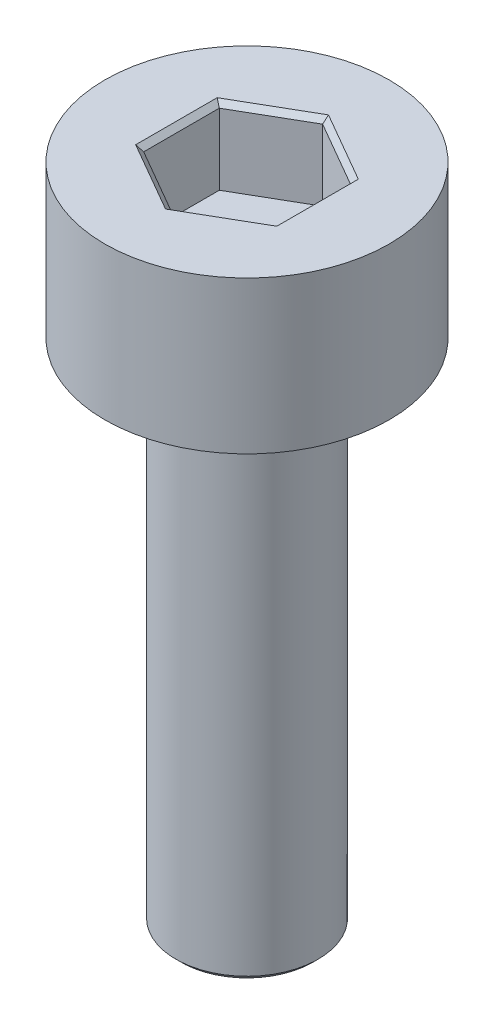
ISO-10303-21;
HEADER;
FILE_DESCRIPTION(('STEP AP214'),'2;1');
FILE_NAME('part.step','',(''),(''),'','','');
FILE_SCHEMA(('AUTOMOTIVE_DESIGN { 1 0 10303 214 1 1 1 1 }'));
ENDSEC;
DATA;
#1=APPLICATION_CONTEXT('core data for automotive mechanical design processes');
#2=APPLICATION_PROTOCOL_DEFINITION('international standard','automotive_design',2000,#1);
#3=PRODUCT_CONTEXT('',#1,'mechanical');
#4=PRODUCT('Part','Part','',(#3));
#5=PRODUCT_RELATED_PRODUCT_CATEGORY('part','',(#4));
#6=PRODUCT_DEFINITION_FORMATION('','',#4);
#7=PRODUCT_DEFINITION_CONTEXT('part definition',#1,'design');
#8=PRODUCT_DEFINITION('design','',#6,#7);
#9=PRODUCT_DEFINITION_SHAPE('','',#8);
#10=(LENGTH_UNIT() NAMED_UNIT(*) SI_UNIT(.MILLI.,.METRE.));
#11=(NAMED_UNIT(*) PLANE_ANGLE_UNIT() SI_UNIT($,.RADIAN.));
#12=(NAMED_UNIT(*) SI_UNIT($,.STERADIAN.) SOLID_ANGLE_UNIT());
#13=UNCERTAINTY_MEASURE_WITH_UNIT(LENGTH_MEASURE(1.E-05),#10,'distance_accuracy_value','');
#14=(GEOMETRIC_REPRESENTATION_CONTEXT(3) GLOBAL_UNCERTAINTY_ASSIGNED_CONTEXT((#13)) GLOBAL_UNIT_ASSIGNED_CONTEXT((#10,
#11,#12)) REPRESENTATION_CONTEXT('',''));
#15=CARTESIAN_POINT('',(0.,0.,0.));
#16=DIRECTION('',(0.,0.,1.));
#17=DIRECTION('',(1.,0.,0.));
#18=AXIS2_PLACEMENT_3D('',#15,#16,#17);
#19=CARTESIAN_POINT('',(0.,3.,0.));
#20=DIRECTION('',(0.,-1.,0.));
#21=DIRECTION('',(0.,0.,-1.));
#22=AXIS2_PLACEMENT_3D('',#19,#20,#21);
#23=CYLINDRICAL_SURFACE('',#22,2.8);
#24=CARTESIAN_POINT('',(0.,3.,0.));
#25=DIRECTION('',(0.,1.,0.));
#26=DIRECTION('',(0.,0.,1.));
#27=AXIS2_PLACEMENT_3D('',#24,#25,#26);
#28=CIRCLE('',#27,2.8);
#29=CARTESIAN_POINT('',(0.,3.,2.8));
#30=VERTEX_POINT('',#29);
#31=EDGE_CURVE('E177',#30,#30,#28,.T.);
#32=ORIENTED_EDGE('',*,*,#31,.F.);
#33=EDGE_LOOP('',(#32));
#34=FACE_BOUND('',#33,.T.);
#35=CARTESIAN_POINT('',(0.,0.,0.));
#36=DIRECTION('',(0.,1.,0.));
#37=DIRECTION('',(0.,0.,1.));
#38=AXIS2_PLACEMENT_3D('',#35,#36,#37);
#39=CIRCLE('',#38,2.8);
#40=CARTESIAN_POINT('',(0.,0.,2.8));
#41=VERTEX_POINT('',#40);
#42=EDGE_CURVE('E162',#41,#41,#39,.T.);
#43=ORIENTED_EDGE('',*,*,#42,.T.);
#44=EDGE_LOOP('',(#43));
#45=FACE_BOUND('',#44,.T.);
#46=ADVANCED_FACE('F43',(#34,#45),#23,.T.);
#47=CARTESIAN_POINT('',(0.,3.,0.));
#48=DIRECTION('',(0.,1.,0.));
#49=DIRECTION('',(0.,0.,1.));
#50=AXIS2_PLACEMENT_3D('',#47,#48,#49);
#51=PLANE('',#50);
#52=DIRECTION('',(0.866025403784439,0.,-0.5));
#53=VECTOR('',#52,1.);
#54=CARTESIAN_POINT('',(-0.0499999999999996,3.,-1.57616623488768));
#55=LINE('',#54,#53);
#56=CARTESIAN_POINT('',(-1.39,3.,-0.80251687417358));
#57=VERTEX_POINT('',#56);
#58=CARTESIAN_POINT('',(0.,3.,-1.60503374834716));
#59=VERTEX_POINT('',#58);
#60=EDGE_CURVE('E200',#57,#59,#55,.T.);
#61=ORIENTED_EDGE('',*,*,#60,.T.);
#62=DIRECTION('',(0.866025403784439,0.,0.5));
#63=VECTOR('',#62,1.);
#64=CARTESIAN_POINT('',(1.34,3.,-0.831384387633062));
#65=LINE('',#64,#63);
#66=CARTESIAN_POINT('',(1.39,3.,-0.802516874173581));
#67=VERTEX_POINT('',#66);
#68=EDGE_CURVE('E203',#59,#67,#65,.T.);
#69=ORIENTED_EDGE('',*,*,#68,.T.);
#70=DIRECTION('',(0.,0.,1.));
#71=VECTOR('',#70,1.);
#72=CARTESIAN_POINT('',(1.39,3.,0.744781847254617));
#73=LINE('',#72,#71);
#74=CARTESIAN_POINT('',(1.39,3.,0.802516874173579));
#75=VERTEX_POINT('',#74);
#76=EDGE_CURVE('E188',#67,#75,#73,.T.);
#77=ORIENTED_EDGE('',*,*,#76,.T.);
#78=DIRECTION('',(-0.866025403784438,0.,0.5));
#79=VECTOR('',#78,1.);
#80=CARTESIAN_POINT('',(0.0499999999999993,3.,1.57616623488768));
#81=LINE('',#80,#79);
#82=CARTESIAN_POINT('',(0.,3.,1.60503374834716));
#83=VERTEX_POINT('',#82);
#84=EDGE_CURVE('E191',#75,#83,#81,.T.);
#85=ORIENTED_EDGE('',*,*,#84,.T.);
#86=DIRECTION('',(-0.866025403784439,0.,-0.5));
#87=VECTOR('',#86,1.);
#88=CARTESIAN_POINT('',(-1.34,3.,0.831384387633061));
#89=LINE('',#88,#87);
#90=CARTESIAN_POINT('',(-1.39,3.,0.80251687417358));
#91=VERTEX_POINT('',#90);
#92=EDGE_CURVE('E194',#83,#91,#89,.T.);
#93=ORIENTED_EDGE('',*,*,#92,.T.);
#94=DIRECTION('',(0.,0.,-1.));
#95=VECTOR('',#94,1.);
#96=CARTESIAN_POINT('',(-1.39,3.,-0.744781847254617));
#97=LINE('',#96,#95);
#98=EDGE_CURVE('E197',#91,#57,#97,.T.);
#99=ORIENTED_EDGE('',*,*,#98,.T.);
#100=EDGE_LOOP('',(#61,#69,#77,#85,#93,#99));
#101=FACE_BOUND('',#100,.T.);
#102=ORIENTED_EDGE('',*,*,#31,.T.);
#103=EDGE_LOOP('',(#102));
#104=FACE_BOUND('',#103,.T.);
#105=ADVANCED_FACE('F274',(#101,#104),#51,.T.);
#106=CARTESIAN_POINT('',(0.,0.,0.));
#107=DIRECTION('',(0.,1.,0.));
#108=DIRECTION('',(0.,0.,1.));
#109=AXIS2_PLACEMENT_3D('',#106,#107,#108);
#110=PLANE('',#109);
#111=CARTESIAN_POINT('',(0.,0.,0.));
#112=DIRECTION('',(0.,-1.,0.));
#113=DIRECTION('',(0.,0.,-1.));
#114=AXIS2_PLACEMENT_3D('',#111,#112,#113);
#115=CIRCLE('',#114,1.4);
#116=CARTESIAN_POINT('',(0.,0.,-1.4));
#117=VERTEX_POINT('',#116);
#118=EDGE_CURVE('E146',#117,#117,#115,.T.);
#119=ORIENTED_EDGE('',*,*,#118,.F.);
#120=EDGE_LOOP('',(#119));
#121=FACE_BOUND('',#120,.T.);
#122=ORIENTED_EDGE('',*,*,#42,.F.);
#123=EDGE_LOOP('',(#122));
#124=FACE_BOUND('',#123,.T.);
#125=ADVANCED_FACE('F293',(#121,#124),#110,.F.);
#126=CARTESIAN_POINT('',(-1.29,1.5,0.744781847254617));
#127=DIRECTION('',(-0.5,0.,0.866025403784438));
#128=DIRECTION('',(0.866025403784439,0.,0.5));
#129=AXIS2_PLACEMENT_3D('',#126,#127,#128);
#130=PLANE('',#129);
#131=DIRECTION('',(0.,1.,0.));
#132=VECTOR('',#131,1.);
#133=CARTESIAN_POINT('',(-1.29,1.5,0.744781847254617));
#134=LINE('',#133,#132);
#135=CARTESIAN_POINT('',(-1.29,1.5,0.744781847254617));
#136=VERTEX_POINT('',#135);
#137=CARTESIAN_POINT('',(-1.29,2.9,0.744781847254617));
#138=VERTEX_POINT('',#137);
#139=EDGE_CURVE('E159',#136,#138,#134,.T.);
#140=ORIENTED_EDGE('',*,*,#139,.T.);
#141=DIRECTION('',(0.866025403784439,0.,0.5));
#142=VECTOR('',#141,1.);
#143=CARTESIAN_POINT('',(0.,2.9,1.48956369450923));
#144=LINE('',#143,#142);
#145=CARTESIAN_POINT('',(0.,2.9,1.48956369450923));
#146=VERTEX_POINT('',#145);
#147=EDGE_CURVE('E70',#138,#146,#144,.T.);
#148=ORIENTED_EDGE('',*,*,#147,.T.);
#149=DIRECTION('',(0.,1.,0.));
#150=VECTOR('',#149,1.);
#151=CARTESIAN_POINT('',(0.,1.5,1.48956369450923));
#152=LINE('',#151,#150);
#153=CARTESIAN_POINT('',(0.,1.5,1.48956369450923));
#154=VERTEX_POINT('',#153);
#155=EDGE_CURVE('E117',#154,#146,#152,.T.);
#156=ORIENTED_EDGE('',*,*,#155,.F.);
#157=DIRECTION('',(0.866025403784439,0.,0.5));
#158=VECTOR('',#157,1.);
#159=CARTESIAN_POINT('',(-1.29,1.5,0.744781847254617));
#160=LINE('',#159,#158);
#161=EDGE_CURVE('E121',#136,#154,#160,.T.);
#162=ORIENTED_EDGE('',*,*,#161,.F.);
#163=EDGE_LOOP('',(#140,#148,#156,#162));
#164=FACE_BOUND('',#163,.T.);
#165=ADVANCED_FACE('F119',(#164),#130,.F.);
#166=CARTESIAN_POINT('',(-1.29,1.5,-0.744781847254617));
#167=DIRECTION('',(-1.,0.,0.));
#168=DIRECTION('',(0.,0.,1.));
#169=AXIS2_PLACEMENT_3D('',#166,#167,#168);
#170=PLANE('',#169);
#171=DIRECTION('',(0.,1.,0.));
#172=VECTOR('',#171,1.);
#173=CARTESIAN_POINT('',(-1.29,1.5,-0.744781847254617));
#174=LINE('',#173,#172);
#175=CARTESIAN_POINT('',(-1.29,1.5,-0.744781847254617));
#176=VERTEX_POINT('',#175);
#177=CARTESIAN_POINT('',(-1.29,2.9,-0.744781847254617));
#178=VERTEX_POINT('',#177);
#179=EDGE_CURVE('E163',#176,#178,#174,.T.);
#180=ORIENTED_EDGE('',*,*,#179,.T.);
#181=DIRECTION('',(0.,0.,1.));
#182=VECTOR('',#181,1.);
#183=CARTESIAN_POINT('',(-1.29,2.9,0.744781847254617));
#184=LINE('',#183,#182);
#185=EDGE_CURVE('E210',#178,#138,#184,.T.);
#186=ORIENTED_EDGE('',*,*,#185,.T.);
#187=ORIENTED_EDGE('',*,*,#139,.F.);
#188=DIRECTION('',(0.,0.,1.));
#189=VECTOR('',#188,1.);
#190=CARTESIAN_POINT('',(-1.29,1.5,-0.744781847254617));
#191=LINE('',#190,#189);
#192=EDGE_CURVE('E126',#176,#136,#191,.T.);
#193=ORIENTED_EDGE('',*,*,#192,.F.);
#194=EDGE_LOOP('',(#180,#186,#187,#193));
#195=FACE_BOUND('',#194,.T.);
#196=ADVANCED_FACE('F265',(#195),#170,.F.);
#197=CARTESIAN_POINT('',(0.,1.5,-1.48956369450924));
#198=DIRECTION('',(-0.5,0.,-0.866025403784438));
#199=DIRECTION('',(-0.866025403784439,0.,0.5));
#200=AXIS2_PLACEMENT_3D('',#197,#198,#199);
#201=PLANE('',#200);
#202=DIRECTION('',(0.,1.,0.));
#203=VECTOR('',#202,1.);
#204=CARTESIAN_POINT('',(0.,1.5,-1.48956369450924));
#205=LINE('',#204,#203);
#206=CARTESIAN_POINT('',(0.,1.5,-1.48956369450924));
#207=VERTEX_POINT('',#206);
#208=CARTESIAN_POINT('',(0.,2.9,-1.48956369450924));
#209=VERTEX_POINT('',#208);
#210=EDGE_CURVE('E167',#207,#209,#205,.T.);
#211=ORIENTED_EDGE('',*,*,#210,.T.);
#212=DIRECTION('',(-0.866025403784439,0.,0.5));
#213=VECTOR('',#212,1.);
#214=CARTESIAN_POINT('',(-1.29,2.9,-0.744781847254617));
#215=LINE('',#214,#213);
#216=EDGE_CURVE('E207',#209,#178,#215,.T.);
#217=ORIENTED_EDGE('',*,*,#216,.T.);
#218=ORIENTED_EDGE('',*,*,#179,.F.);
#219=DIRECTION('',(-0.866025403784439,0.,0.5));
#220=VECTOR('',#219,1.);
#221=CARTESIAN_POINT('',(0.,1.5,-1.48956369450924));
#222=LINE('',#221,#220);
#223=EDGE_CURVE('E154',#207,#176,#222,.T.);
#224=ORIENTED_EDGE('',*,*,#223,.F.);
#225=EDGE_LOOP('',(#211,#217,#218,#224));
#226=FACE_BOUND('',#225,.T.);
#227=ADVANCED_FACE('F266',(#226),#201,.F.);
#228=CARTESIAN_POINT('',(1.29,1.5,-0.744781847254619));
#229=DIRECTION('',(0.5,0.,-0.866025403784438));
#230=DIRECTION('',(-0.866025403784439,0.,-0.5));
#231=AXIS2_PLACEMENT_3D('',#228,#229,#230);
#232=PLANE('',#231);
#233=DIRECTION('',(0.,1.,0.));
#234=VECTOR('',#233,1.);
#235=CARTESIAN_POINT('',(1.29,1.5,-0.744781847254619));
#236=LINE('',#235,#234);
#237=CARTESIAN_POINT('',(1.29,1.5,-0.744781847254619));
#238=VERTEX_POINT('',#237);
#239=CARTESIAN_POINT('',(1.29,2.9,-0.744781847254619));
#240=VERTEX_POINT('',#239);
#241=EDGE_CURVE('E171',#238,#240,#236,.T.);
#242=ORIENTED_EDGE('',*,*,#241,.T.);
#243=DIRECTION('',(-0.866025403784439,0.,-0.5));
#244=VECTOR('',#243,1.);
#245=CARTESIAN_POINT('',(0.,2.9,-1.48956369450924));
#246=LINE('',#245,#244);
#247=EDGE_CURVE('E184',#240,#209,#246,.T.);
#248=ORIENTED_EDGE('',*,*,#247,.T.);
#249=ORIENTED_EDGE('',*,*,#210,.F.);
#250=DIRECTION('',(-0.866025403784439,0.,-0.5));
#251=VECTOR('',#250,1.);
#252=CARTESIAN_POINT('',(1.29,1.5,-0.744781847254619));
#253=LINE('',#252,#251);
#254=EDGE_CURVE('E150',#238,#207,#253,.T.);
#255=ORIENTED_EDGE('',*,*,#254,.F.);
#256=EDGE_LOOP('',(#242,#248,#249,#255));
#257=FACE_BOUND('',#256,.T.);
#258=ADVANCED_FACE('F261',(#257),#232,.F.);
#259=CARTESIAN_POINT('',(1.29,1.5,0.744781847254617));
#260=DIRECTION('',(1.,0.,0.));
#261=DIRECTION('',(0.,0.,-1.));
#262=AXIS2_PLACEMENT_3D('',#259,#260,#261);
#263=PLANE('',#262);
#264=DIRECTION('',(0.,1.,0.));
#265=VECTOR('',#264,1.);
#266=CARTESIAN_POINT('',(1.29,1.5,0.744781847254617));
#267=LINE('',#266,#265);
#268=CARTESIAN_POINT('',(1.29,1.5,0.744781847254617));
#269=VERTEX_POINT('',#268);
#270=CARTESIAN_POINT('',(1.29,2.9,0.744781847254617));
#271=VERTEX_POINT('',#270);
#272=EDGE_CURVE('E125',#269,#271,#267,.T.);
#273=ORIENTED_EDGE('',*,*,#272,.T.);
#274=DIRECTION('',(0.,0.,-1.));
#275=VECTOR('',#274,1.);
#276=CARTESIAN_POINT('',(1.29,2.9,-0.744781847254619));
#277=LINE('',#276,#275);
#278=EDGE_CURVE('E217',#271,#240,#277,.T.);
#279=ORIENTED_EDGE('',*,*,#278,.T.);
#280=ORIENTED_EDGE('',*,*,#241,.F.);
#281=DIRECTION('',(0.,0.,-1.));
#282=VECTOR('',#281,1.);
#283=CARTESIAN_POINT('',(1.29,1.5,0.744781847254617));
#284=LINE('',#283,#282);
#285=EDGE_CURVE('E135',#269,#238,#284,.T.);
#286=ORIENTED_EDGE('',*,*,#285,.F.);
#287=EDGE_LOOP('',(#273,#279,#280,#286));
#288=FACE_BOUND('',#287,.T.);
#289=ADVANCED_FACE('F258',(#288),#263,.F.);
#290=CARTESIAN_POINT('',(0.,1.5,1.48956369450923));
#291=DIRECTION('',(0.5,0.,0.866025403784438));
#292=DIRECTION('',(0.866025403784438,0.,-0.5));
#293=AXIS2_PLACEMENT_3D('',#290,#291,#292);
#294=PLANE('',#293);
#295=ORIENTED_EDGE('',*,*,#155,.T.);
#296=DIRECTION('',(0.866025403784438,0.,-0.5));
#297=VECTOR('',#296,1.);
#298=CARTESIAN_POINT('',(1.29,2.9,0.744781847254617));
#299=LINE('',#298,#297);
#300=EDGE_CURVE('E62',#146,#271,#299,.T.);
#301=ORIENTED_EDGE('',*,*,#300,.T.);
#302=ORIENTED_EDGE('',*,*,#272,.F.);
#303=DIRECTION('',(0.866025403784438,0.,-0.5));
#304=VECTOR('',#303,1.);
#305=CARTESIAN_POINT('',(0.,1.5,1.48956369450923));
#306=LINE('',#305,#304);
#307=EDGE_CURVE('E129',#154,#269,#306,.T.);
#308=ORIENTED_EDGE('',*,*,#307,.F.);
#309=EDGE_LOOP('',(#295,#301,#302,#308));
#310=FACE_BOUND('',#309,.T.);
#311=ADVANCED_FACE('F130',(#310),#294,.F.);
#312=CARTESIAN_POINT('',(0.,1.5,0.));
#313=DIRECTION('',(0.,1.,0.));
#314=DIRECTION('',(0.,0.,1.));
#315=AXIS2_PLACEMENT_3D('',#312,#313,#314);
#316=PLANE('',#315);
#317=ORIENTED_EDGE('',*,*,#161,.T.);
#318=ORIENTED_EDGE('',*,*,#307,.T.);
#319=ORIENTED_EDGE('',*,*,#285,.T.);
#320=ORIENTED_EDGE('',*,*,#254,.T.);
#321=ORIENTED_EDGE('',*,*,#223,.T.);
#322=ORIENTED_EDGE('',*,*,#192,.T.);
#323=EDGE_LOOP('',(#317,#318,#319,#320,#321,#322));
#324=FACE_BOUND('',#323,.T.);
#325=ADVANCED_FACE('F137',(#324),#316,.T.);
#326=CARTESIAN_POINT('',(0.,-10.,0.));
#327=DIRECTION('',(0.,1.,0.));
#328=DIRECTION('',(0.,0.,1.));
#329=AXIS2_PLACEMENT_3D('',#326,#327,#328);
#330=CYLINDRICAL_SURFACE('',#329,1.4);
#331=CARTESIAN_POINT('',(0.,-9.9,0.));
#332=DIRECTION('',(0.,-1.,0.));
#333=DIRECTION('',(0.,0.,-1.));
#334=AXIS2_PLACEMENT_3D('',#331,#332,#333);
#335=CIRCLE('',#334,1.4);
#336=CARTESIAN_POINT('',(0.,-9.9,-1.4));
#337=VERTEX_POINT('',#336);
#338=EDGE_CURVE('E11',#337,#337,#335,.F.);
#339=ORIENTED_EDGE('',*,*,#338,.T.);
#340=EDGE_LOOP('',(#339));
#341=FACE_BOUND('',#340,.T.);
#342=ORIENTED_EDGE('',*,*,#118,.T.);
#343=EDGE_LOOP('',(#342));
#344=FACE_BOUND('',#343,.T.);
#345=ADVANCED_FACE('F315',(#341,#344),#330,.T.);
#346=CARTESIAN_POINT('',(0.,-10.,0.));
#347=DIRECTION('',(0.,-1.,0.));
#348=DIRECTION('',(0.,0.,-1.));
#349=AXIS2_PLACEMENT_3D('',#346,#347,#348);
#350=PLANE('',#349);
#351=CARTESIAN_POINT('',(0.,-10.,0.));
#352=DIRECTION('',(0.,-1.,0.));
#353=DIRECTION('',(0.,0.,-1.));
#354=AXIS2_PLACEMENT_3D('',#351,#352,#353);
#355=CIRCLE('',#354,1.3);
#356=CARTESIAN_POINT('',(0.,-10.,-1.3));
#357=VERTEX_POINT('',#356);
#358=EDGE_CURVE('E54',#357,#357,#355,.T.);
#359=ORIENTED_EDGE('',*,*,#358,.T.);
#360=EDGE_LOOP('',(#359));
#361=FACE_BOUND('',#360,.T.);
#362=ADVANCED_FACE('F318',(#361),#350,.T.);
#363=CARTESIAN_POINT('',(-1.29,2.9,0.744781847254617));
#364=DIRECTION('',(0.353553390593274,0.707106781186548,-0.612372435695795));
#365=DIRECTION('',(-0.866025403784439,0.,-0.5));
#366=AXIS2_PLACEMENT_3D('',#363,#364,#365);
#367=PLANE('',#366);
#368=DIRECTION('',(-0.654653670707977,0.654653670707977,0.377964473009227));
#369=VECTOR('',#368,1.);
#370=CARTESIAN_POINT('',(-0.921428571428572,2.53142857142857,0.531987033753298));
#371=LINE('',#370,#369);
#372=EDGE_CURVE('E144',#91,#138,#371,.F.);
#373=ORIENTED_EDGE('',*,*,#372,.F.);
#374=ORIENTED_EDGE('',*,*,#92,.F.);
#375=DIRECTION('',(0.,0.654653670707978,0.755928946018454));
#376=VECTOR('',#375,1.);
#377=CARTESIAN_POINT('',(0.,2.53142857142857,1.0639740675066));
#378=LINE('',#377,#376);
#379=EDGE_CURVE('E48',#146,#83,#378,.T.);
#380=ORIENTED_EDGE('',*,*,#379,.F.);
#381=ORIENTED_EDGE('',*,*,#147,.F.);
#382=EDGE_LOOP('',(#373,#374,#380,#381));
#383=FACE_BOUND('',#382,.T.);
#384=ADVANCED_FACE('F246',(#383),#367,.T.);
#385=CARTESIAN_POINT('',(0.,2.9,1.48956369450923));
#386=DIRECTION('',(-0.353553390593275,0.707106781186546,-0.612372435695796));
#387=DIRECTION('',(-0.866025403784438,0.,0.5));
#388=AXIS2_PLACEMENT_3D('',#385,#386,#387);
#389=PLANE('',#388);
#390=ORIENTED_EDGE('',*,*,#379,.T.);
#391=ORIENTED_EDGE('',*,*,#84,.F.);
#392=DIRECTION('',(0.654653670707978,0.654653670707978,0.377964473009224));
#393=VECTOR('',#392,1.);
#394=CARTESIAN_POINT('',(0.921428571428568,2.53142857142857,0.531987033753299));
#395=LINE('',#394,#393);
#396=EDGE_CURVE('E233',#271,#75,#395,.T.);
#397=ORIENTED_EDGE('',*,*,#396,.F.);
#398=ORIENTED_EDGE('',*,*,#300,.F.);
#399=EDGE_LOOP('',(#390,#391,#397,#398));
#400=FACE_BOUND('',#399,.T.);
#401=ADVANCED_FACE('F250',(#400),#389,.T.);
#402=CARTESIAN_POINT('',(-1.29,2.9,-0.744781847254617));
#403=DIRECTION('',(0.707106781186548,0.707106781186548,0.));
#404=DIRECTION('',(0.,0.,-1.));
#405=AXIS2_PLACEMENT_3D('',#402,#403,#404);
#406=PLANE('',#405);
#407=ORIENTED_EDGE('',*,*,#372,.T.);
#408=ORIENTED_EDGE('',*,*,#185,.F.);
#409=DIRECTION('',(-0.654653670707977,0.654653670707977,-0.377964473009229));
#410=VECTOR('',#409,1.);
#411=CARTESIAN_POINT('',(-0.921428571428573,2.53142857142857,-0.531987033753298));
#412=LINE('',#411,#410);
#413=EDGE_CURVE('E229',#57,#178,#412,.F.);
#414=ORIENTED_EDGE('',*,*,#413,.F.);
#415=ORIENTED_EDGE('',*,*,#98,.F.);
#416=EDGE_LOOP('',(#407,#408,#414,#415));
#417=FACE_BOUND('',#416,.T.);
#418=ADVANCED_FACE('F242',(#417),#406,.T.);
#419=CARTESIAN_POINT('',(1.29,2.9,0.744781847254617));
#420=DIRECTION('',(-0.707106781186548,0.707106781186548,0.));
#421=DIRECTION('',(0.,0.,1.));
#422=AXIS2_PLACEMENT_3D('',#419,#420,#421);
#423=PLANE('',#422);
#424=ORIENTED_EDGE('',*,*,#396,.T.);
#425=ORIENTED_EDGE('',*,*,#76,.F.);
#426=DIRECTION('',(-0.654653670707978,-0.654653670707978,0.377964473009226));
#427=VECTOR('',#426,1.);
#428=CARTESIAN_POINT('',(1.29,2.9,-0.744781847254619));
#429=LINE('',#428,#427);
#430=EDGE_CURVE('E226',#240,#67,#429,.F.);
#431=ORIENTED_EDGE('',*,*,#430,.F.);
#432=ORIENTED_EDGE('',*,*,#278,.F.);
#433=EDGE_LOOP('',(#424,#425,#431,#432));
#434=FACE_BOUND('',#433,.T.);
#435=ADVANCED_FACE('F255',(#434),#423,.T.);
#436=CARTESIAN_POINT('',(0.,2.9,-1.48956369450924));
#437=DIRECTION('',(0.353553390593274,0.707106781186548,0.612372435695794));
#438=DIRECTION('',(0.866025403784439,0.,-0.5));
#439=AXIS2_PLACEMENT_3D('',#436,#437,#438);
#440=PLANE('',#439);
#441=ORIENTED_EDGE('',*,*,#413,.T.);
#442=ORIENTED_EDGE('',*,*,#216,.F.);
#443=DIRECTION('',(0.,0.654653670707977,-0.755928946018455));
#444=VECTOR('',#443,1.);
#445=CARTESIAN_POINT('',(0.,2.53142857142857,-1.06397406750659));
#446=LINE('',#445,#444);
#447=EDGE_CURVE('E223',#59,#209,#446,.F.);
#448=ORIENTED_EDGE('',*,*,#447,.F.);
#449=ORIENTED_EDGE('',*,*,#60,.F.);
#450=EDGE_LOOP('',(#441,#442,#448,#449));
#451=FACE_BOUND('',#450,.T.);
#452=ADVANCED_FACE('F270',(#451),#440,.T.);
#453=CARTESIAN_POINT('',(1.29,2.9,-0.744781847254619));
#454=DIRECTION('',(-0.353553390593274,0.707106781186547,0.612372435695795));
#455=DIRECTION('',(0.866025403784439,0.,0.5));
#456=AXIS2_PLACEMENT_3D('',#453,#454,#455);
#457=PLANE('',#456);
#458=ORIENTED_EDGE('',*,*,#430,.T.);
#459=ORIENTED_EDGE('',*,*,#68,.F.);
#460=ORIENTED_EDGE('',*,*,#447,.T.);
#461=ORIENTED_EDGE('',*,*,#247,.F.);
#462=EDGE_LOOP('',(#458,#459,#460,#461));
#463=FACE_BOUND('',#462,.T.);
#464=ADVANCED_FACE('F277',(#463),#457,.T.);
#465=CARTESIAN_POINT('',(0.,-10.,0.));
#466=DIRECTION('',(0.,1.,0.));
#467=DIRECTION('',(0.,0.,1.));
#468=AXIS2_PLACEMENT_3D('',#465,#466,#467);
#469=CONICAL_SURFACE('',#468,1.3,0.785398163397448);
#470=ORIENTED_EDGE('',*,*,#338,.F.);
#471=EDGE_LOOP('',(#470));
#472=FACE_BOUND('',#471,.T.);
#473=ORIENTED_EDGE('',*,*,#358,.F.);
#474=EDGE_LOOP('',(#473));
#475=FACE_BOUND('',#474,.T.);
#476=ADVANCED_FACE('F46',(#472,#475),#469,.T.);
#477=CLOSED_SHELL('',(#46,#105,#125,#165,#196,#227,#258,#289,#311,#325,#345,#362,#384,#401,#418,
#435,#452,#464,#476));
#478=MANIFOLD_SOLID_BREP('B2',#477);
#479=ADVANCED_BREP_SHAPE_REPRESENTATION('',(#18,#478),#14);
#480=SHAPE_DEFINITION_REPRESENTATION(#9,#479);
ENDSEC;
END-ISO-10303-21;
